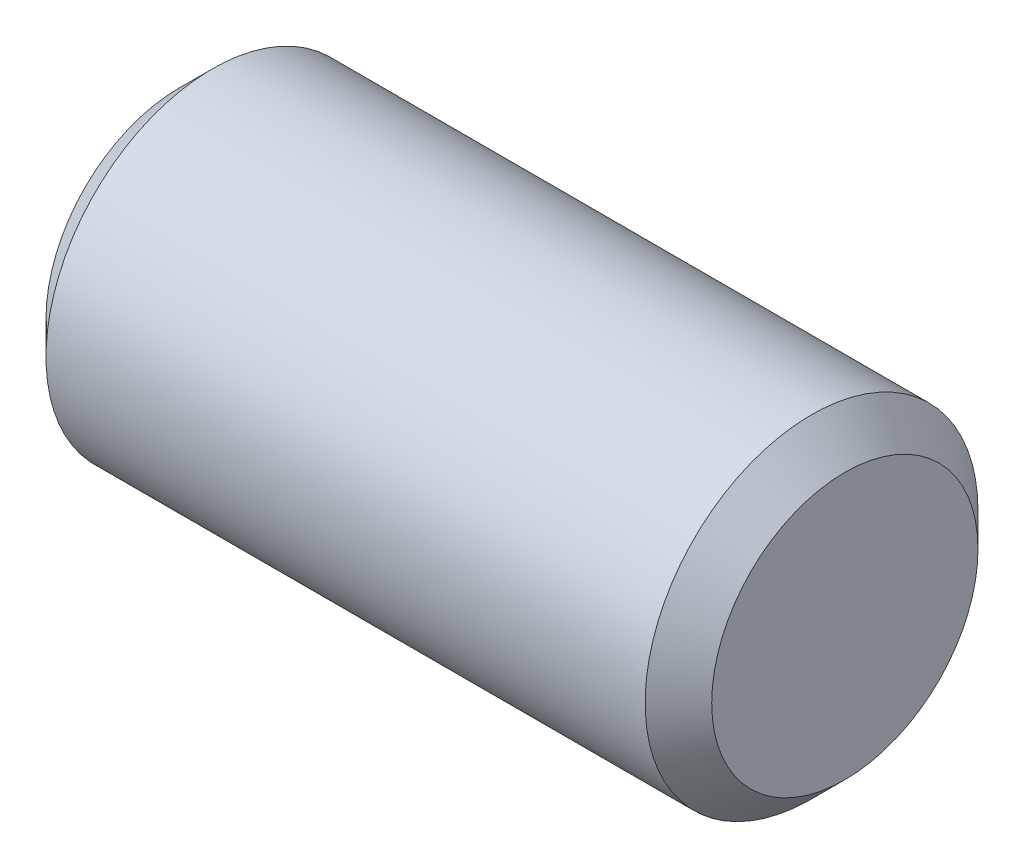
ISO-10303-21;
HEADER;
FILE_DESCRIPTION(('STEP AP214'),'2;1');
FILE_NAME('part.step','',(''),(''),'','','');
FILE_SCHEMA(('AUTOMOTIVE_DESIGN { 1 0 10303 214 1 1 1 1 }'));
ENDSEC;
DATA;
#1=APPLICATION_CONTEXT('core data for automotive mechanical design processes');
#2=APPLICATION_PROTOCOL_DEFINITION('international standard','automotive_design',2000,#1);
#3=PRODUCT_CONTEXT('',#1,'mechanical');
#4=PRODUCT('Part','Part','',(#3));
#5=PRODUCT_RELATED_PRODUCT_CATEGORY('part','',(#4));
#6=PRODUCT_DEFINITION_FORMATION('','',#4);
#7=PRODUCT_DEFINITION_CONTEXT('part definition',#1,'design');
#8=PRODUCT_DEFINITION('design','',#6,#7);
#9=PRODUCT_DEFINITION_SHAPE('','',#8);
#10=(LENGTH_UNIT() NAMED_UNIT(*) SI_UNIT(.MILLI.,.METRE.));
#11=(NAMED_UNIT(*) PLANE_ANGLE_UNIT() SI_UNIT($,.RADIAN.));
#12=(NAMED_UNIT(*) SI_UNIT($,.STERADIAN.) SOLID_ANGLE_UNIT());
#13=UNCERTAINTY_MEASURE_WITH_UNIT(LENGTH_MEASURE(1.E-05),#10,'distance_accuracy_value','');
#14=(GEOMETRIC_REPRESENTATION_CONTEXT(3) GLOBAL_UNCERTAINTY_ASSIGNED_CONTEXT((#13)) GLOBAL_UNIT_ASSIGNED_CONTEXT((#10,
#11,#12)) REPRESENTATION_CONTEXT('',''));
#15=CARTESIAN_POINT('',(0.,0.,0.));
#16=DIRECTION('',(0.,0.,1.));
#17=DIRECTION('',(1.,0.,0.));
#18=AXIS2_PLACEMENT_3D('',#15,#16,#17);
#19=CARTESIAN_POINT('',(-4.7625,0.,0.));
#20=DIRECTION('',(1.,0.,0.));
#21=DIRECTION('',(0.,0.,-1.));
#22=AXIS2_PLACEMENT_3D('',#19,#20,#21);
#23=CYLINDRICAL_SURFACE('',#22,2.38125);
#24=CARTESIAN_POINT('',(4.28625,0.,0.));
#25=DIRECTION('',(1.,0.,0.));
#26=DIRECTION('',(0.,0.,-1.));
#27=AXIS2_PLACEMENT_3D('',#24,#25,#26);
#28=CIRCLE('',#27,2.38125);
#29=CARTESIAN_POINT('',(4.28625,0.,-2.38125));
#30=VERTEX_POINT('',#29);
#31=EDGE_CURVE('E42',#30,#30,#28,.F.);
#32=ORIENTED_EDGE('',*,*,#31,.T.);
#33=EDGE_LOOP('',(#32));
#34=FACE_BOUND('',#33,.T.);
#35=CARTESIAN_POINT('',(-4.28625000000001,0.,0.));
#36=DIRECTION('',(1.,0.,0.));
#37=DIRECTION('',(0.,0.,-1.));
#38=AXIS2_PLACEMENT_3D('',#35,#36,#37);
#39=CIRCLE('',#38,2.38125);
#40=CARTESIAN_POINT('',(-4.28625000000001,0.,-2.38125));
#41=VERTEX_POINT('',#40);
#42=EDGE_CURVE('E46',#41,#41,#39,.T.);
#43=ORIENTED_EDGE('',*,*,#42,.T.);
#44=EDGE_LOOP('',(#43));
#45=FACE_BOUND('',#44,.T.);
#46=ADVANCED_FACE('F35',(#34,#45),#23,.T.);
#47=CARTESIAN_POINT('',(-4.7625,0.,0.));
#48=DIRECTION('',(1.,0.,0.));
#49=DIRECTION('',(0.,0.,-1.));
#50=AXIS2_PLACEMENT_3D('',#47,#48,#49);
#51=PLANE('',#50);
#52=CARTESIAN_POINT('',(-4.7625,0.,0.));
#53=DIRECTION('',(1.,0.,0.));
#54=DIRECTION('',(0.,0.,-1.));
#55=AXIS2_PLACEMENT_3D('',#52,#53,#54);
#56=CIRCLE('',#55,1.905);
#57=CARTESIAN_POINT('',(-4.7625,0.,-1.905));
#58=VERTEX_POINT('',#57);
#59=EDGE_CURVE('E10',#58,#58,#56,.F.);
#60=ORIENTED_EDGE('',*,*,#59,.T.);
#61=EDGE_LOOP('',(#60));
#62=FACE_BOUND('',#61,.T.);
#63=ADVANCED_FACE('F66',(#62),#51,.F.);
#64=CARTESIAN_POINT('',(4.7625,0.,0.));
#65=DIRECTION('',(1.,0.,0.));
#66=DIRECTION('',(0.,0.,-1.));
#67=AXIS2_PLACEMENT_3D('',#64,#65,#66);
#68=PLANE('',#67);
#69=CARTESIAN_POINT('',(4.7625,0.,0.));
#70=DIRECTION('',(1.,0.,0.));
#71=DIRECTION('',(0.,0.,-1.));
#72=AXIS2_PLACEMENT_3D('',#69,#70,#71);
#73=CIRCLE('',#72,1.905);
#74=CARTESIAN_POINT('',(4.7625,0.,-1.905));
#75=VERTEX_POINT('',#74);
#76=EDGE_CURVE('E50',#75,#75,#73,.T.);
#77=ORIENTED_EDGE('',*,*,#76,.T.);
#78=EDGE_LOOP('',(#77));
#79=FACE_BOUND('',#78,.T.);
#80=ADVANCED_FACE('F56',(#79),#68,.T.);
#81=CARTESIAN_POINT('',(4.7625,0.,0.));
#82=DIRECTION('',(-1.,0.,0.));
#83=DIRECTION('',(0.,0.,1.));
#84=AXIS2_PLACEMENT_3D('',#81,#82,#83);
#85=CONICAL_SURFACE('',#84,1.905,0.785398163397445);
#86=ORIENTED_EDGE('',*,*,#31,.F.);
#87=EDGE_LOOP('',(#86));
#88=FACE_BOUND('',#87,.T.);
#89=ORIENTED_EDGE('',*,*,#76,.F.);
#90=EDGE_LOOP('',(#89));
#91=FACE_BOUND('',#90,.T.);
#92=ADVANCED_FACE('F58',(#88,#91),#85,.T.);
#93=CARTESIAN_POINT('',(-4.28625000000001,0.,0.));
#94=DIRECTION('',(1.,0.,0.));
#95=DIRECTION('',(0.,0.,-1.));
#96=AXIS2_PLACEMENT_3D('',#93,#94,#95);
#97=CONICAL_SURFACE('',#96,2.38125,0.785398163397451);
#98=ORIENTED_EDGE('',*,*,#59,.F.);
#99=EDGE_LOOP('',(#98));
#100=FACE_BOUND('',#99,.T.);
#101=ORIENTED_EDGE('',*,*,#42,.F.);
#102=EDGE_LOOP('',(#101));
#103=FACE_BOUND('',#102,.T.);
#104=ADVANCED_FACE('F37',(#100,#103),#97,.T.);
#105=CLOSED_SHELL('',(#46,#63,#80,#92,#104));
#106=MANIFOLD_SOLID_BREP('B2',#105);
#107=ADVANCED_BREP_SHAPE_REPRESENTATION('',(#18,#106),#14);
#108=SHAPE_DEFINITION_REPRESENTATION(#9,#107);
ENDSEC;
END-ISO-10303-21;
